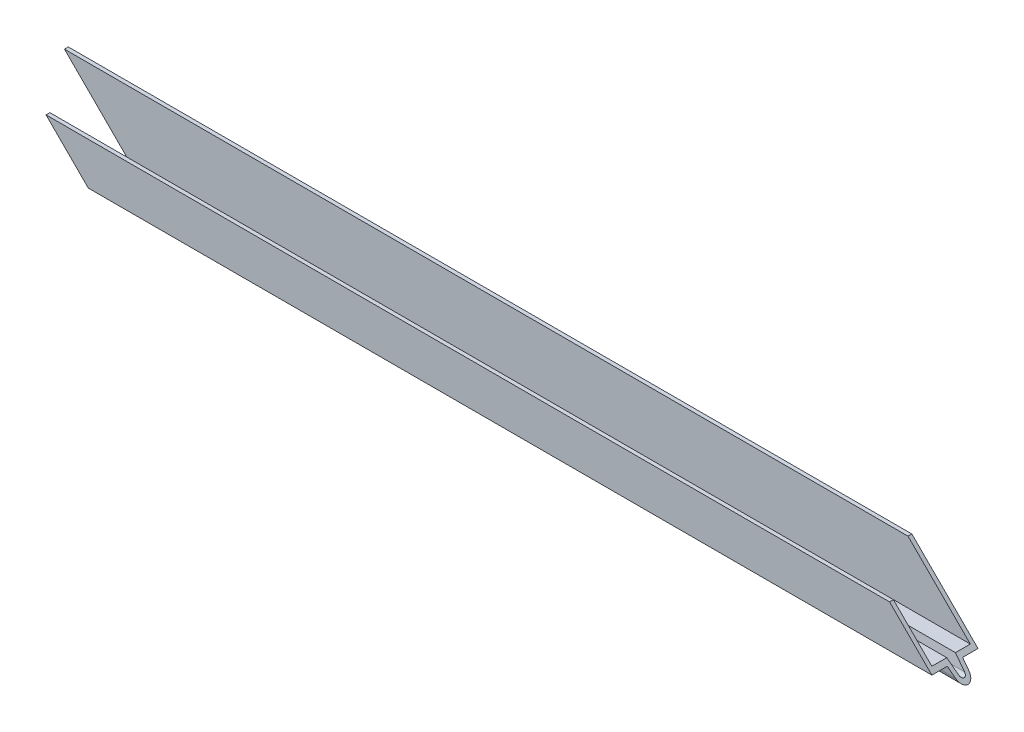
ISO-10303-21;
HEADER;
FILE_DESCRIPTION(('STEP AP214'),'2;1');
FILE_NAME('part.step','',(''),(''),'','','');
FILE_SCHEMA(('AUTOMOTIVE_DESIGN { 1 0 10303 214 1 1 1 1 }'));
ENDSEC;
DATA;
#1=APPLICATION_CONTEXT('core data for automotive mechanical design processes');
#2=APPLICATION_PROTOCOL_DEFINITION('international standard','automotive_design',2000,#1);
#3=PRODUCT_CONTEXT('',#1,'mechanical');
#4=PRODUCT('Part','Part','',(#3));
#5=PRODUCT_RELATED_PRODUCT_CATEGORY('part','',(#4));
#6=PRODUCT_DEFINITION_FORMATION('','',#4);
#7=PRODUCT_DEFINITION_CONTEXT('part definition',#1,'design');
#8=PRODUCT_DEFINITION('design','',#6,#7);
#9=PRODUCT_DEFINITION_SHAPE('','',#8);
#10=(LENGTH_UNIT() NAMED_UNIT(*) SI_UNIT(.MILLI.,.METRE.));
#11=(NAMED_UNIT(*) PLANE_ANGLE_UNIT() SI_UNIT($,.RADIAN.));
#12=(NAMED_UNIT(*) SI_UNIT($,.STERADIAN.) SOLID_ANGLE_UNIT());
#13=UNCERTAINTY_MEASURE_WITH_UNIT(LENGTH_MEASURE(1.E-05),#10,'distance_accuracy_value','');
#14=(GEOMETRIC_REPRESENTATION_CONTEXT(3) GLOBAL_UNCERTAINTY_ASSIGNED_CONTEXT((#13)) GLOBAL_UNIT_ASSIGNED_CONTEXT((#10,
#11,#12)) REPRESENTATION_CONTEXT('',''));
#15=CARTESIAN_POINT('',(0.,0.,0.));
#16=DIRECTION('',(0.,0.,1.));
#17=DIRECTION('',(1.,0.,0.));
#18=AXIS2_PLACEMENT_3D('',#15,#16,#17);
#19=CARTESIAN_POINT('',(152.4,0.,-7.62));
#20=DIRECTION('',(0.,-1.,0.));
#21=DIRECTION('',(0.,0.,-1.));
#22=AXIS2_PLACEMENT_3D('',#19,#20,#21);
#23=PLANE('',#22);
#24=DIRECTION('',(-1.,0.,0.));
#25=VECTOR('',#24,1.);
#26=CARTESIAN_POINT('',(152.4,0.,-6.35));
#27=LINE('',#26,#25);
#28=CARTESIAN_POINT('',(126.238,0.,-6.35));
#29=VERTEX_POINT('',#28);
#30=CARTESIAN_POINT('',(-152.4,0.,-6.35));
#31=VERTEX_POINT('',#30);
#32=EDGE_CURVE('E11',#29,#31,#27,.T.);
#33=ORIENTED_EDGE('',*,*,#32,.F.);
#34=DIRECTION('',(0.,0.,1.));
#35=VECTOR('',#34,1.);
#36=CARTESIAN_POINT('',(126.238,0.,-7.62));
#37=LINE('',#36,#35);
#38=CARTESIAN_POINT('',(126.238,0.,-7.62));
#39=VERTEX_POINT('',#38);
#40=EDGE_CURVE('E157',#39,#29,#37,.T.);
#41=ORIENTED_EDGE('',*,*,#40,.F.);
#42=DIRECTION('',(-1.,0.,0.));
#43=VECTOR('',#42,1.);
#44=CARTESIAN_POINT('',(152.4,0.,-7.62));
#45=LINE('',#44,#43);
#46=CARTESIAN_POINT('',(-152.4,0.,-7.62));
#47=VERTEX_POINT('',#46);
#48=EDGE_CURVE('E165',#39,#47,#45,.T.);
#49=ORIENTED_EDGE('',*,*,#48,.T.);
#50=DIRECTION('',(0.,0.,1.));
#51=VECTOR('',#50,1.);
#52=CARTESIAN_POINT('',(-152.4,0.,-7.62));
#53=LINE('',#52,#51);
#54=EDGE_CURVE('E173',#47,#31,#53,.T.);
#55=ORIENTED_EDGE('',*,*,#54,.T.);
#56=EDGE_LOOP('',(#33,#41,#49,#55));
#57=FACE_BOUND('',#56,.T.);
#58=ADVANCED_FACE('F45',(#57),#23,.F.);
#59=CARTESIAN_POINT('',(152.4,0.,-6.35));
#60=DIRECTION('',(0.,0.,-1.));
#61=DIRECTION('',(-1.,0.,0.));
#62=AXIS2_PLACEMENT_3D('',#59,#60,#61);
#63=PLANE('',#62);
#64=DIRECTION('',(-1.,0.,0.));
#65=VECTOR('',#64,1.);
#66=CARTESIAN_POINT('',(152.4,-20.574,-6.35));
#67=LINE('',#66,#65);
#68=CARTESIAN_POINT('',(146.812,-20.574,-6.35));
#69=VERTEX_POINT('',#68);
#70=CARTESIAN_POINT('',(-131.826,-20.574,-6.35));
#71=VERTEX_POINT('',#70);
#72=EDGE_CURVE('E52',#69,#71,#67,.T.);
#73=ORIENTED_EDGE('',*,*,#72,.F.);
#74=DIRECTION('',(-0.707106781186547,0.707106781186548,0.));
#75=VECTOR('',#74,1.);
#76=CARTESIAN_POINT('',(139.319,-13.081,-6.35));
#77=LINE('',#76,#75);
#78=EDGE_CURVE('E255',#69,#29,#77,.T.);
#79=ORIENTED_EDGE('',*,*,#78,.T.);
#80=ORIENTED_EDGE('',*,*,#32,.T.);
#81=DIRECTION('',(0.70710678118655,-0.707106781186545,0.));
#82=VECTOR('',#81,1.);
#83=CARTESIAN_POINT('',(1.2490009027033E-12,-152.4,-6.35));
#84=LINE('',#83,#82);
#85=EDGE_CURVE('E177',#31,#71,#84,.T.);
#86=ORIENTED_EDGE('',*,*,#85,.T.);
#87=EDGE_LOOP('',(#73,#79,#80,#86));
#88=FACE_BOUND('',#87,.T.);
#89=ADVANCED_FACE('F219',(#88),#63,.F.);
#90=CARTESIAN_POINT('',(152.4,-20.574,-6.35));
#91=DIRECTION('',(0.,-1.,0.));
#92=DIRECTION('',(0.,0.,-1.));
#93=AXIS2_PLACEMENT_3D('',#90,#91,#92);
#94=PLANE('',#93);
#95=DIRECTION('',(-1.,0.,0.));
#96=VECTOR('',#95,1.);
#97=CARTESIAN_POINT('',(152.4,-20.574,-1.4360058429734));
#98=LINE('',#97,#96);
#99=CARTESIAN_POINT('',(146.812,-20.574,-1.4360058429734));
#100=VERTEX_POINT('',#99);
#101=CARTESIAN_POINT('',(-131.826,-20.574,-1.4360058429734));
#102=VERTEX_POINT('',#101);
#103=EDGE_CURVE('E202',#100,#102,#98,.T.);
#104=ORIENTED_EDGE('',*,*,#103,.F.);
#105=DIRECTION('',(0.,0.,-1.));
#106=VECTOR('',#105,1.);
#107=CARTESIAN_POINT('',(146.812,-20.574,-6.35));
#108=LINE('',#107,#106);
#109=EDGE_CURVE('E211',#100,#69,#108,.T.);
#110=ORIENTED_EDGE('',*,*,#109,.T.);
#111=ORIENTED_EDGE('',*,*,#72,.T.);
#112=DIRECTION('',(0.,0.,1.));
#113=VECTOR('',#112,1.);
#114=CARTESIAN_POINT('',(-131.826,-20.574,-6.3499999999998));
#115=LINE('',#114,#113);
#116=EDGE_CURVE('E210',#71,#102,#115,.T.);
#117=ORIENTED_EDGE('',*,*,#116,.T.);
#118=EDGE_LOOP('',(#104,#110,#111,#117));
#119=FACE_BOUND('',#118,.T.);
#120=ADVANCED_FACE('F209',(#119),#94,.F.);
#121=CARTESIAN_POINT('',(152.4,-24.0709187171227,-0.944545967582546));
#122=DIRECTION('',(0.,-0.139173100960069,-0.99026806874157));
#123=DIRECTION('',(0.,0.99026806874157,-0.139173100960069));
#124=AXIS2_PLACEMENT_3D('',#121,#122,#123);
#125=PLANE('',#124);
#126=DIRECTION('',(-1.,0.,0.));
#127=VECTOR('',#126,1.);
#128=CARTESIAN_POINT('',(152.4,-24.0709187171227,-0.944545967582547));
#129=LINE('',#128,#127);
#130=CARTESIAN_POINT('',(150.308918717123,-24.0709187171227,-0.944545967582547));
#131=VERTEX_POINT('',#130);
#132=CARTESIAN_POINT('',(-128.329081282877,-24.0709187171227,-0.944545967582547));
#133=VERTEX_POINT('',#132);
#134=EDGE_CURVE('E200',#131,#133,#129,.T.);
#135=ORIENTED_EDGE('',*,*,#134,.F.);
#136=DIRECTION('',(-0.703640787534026,0.703640787534027,-0.0988902636106829));
#137=VECTOR('',#136,1.);
#138=CARTESIAN_POINT('',(151.344234719447,-25.1062347194474,-0.799041792435087));
#139=LINE('',#138,#137);
#140=EDGE_CURVE('E259',#131,#100,#139,.T.);
#141=ORIENTED_EDGE('',*,*,#140,.T.);
#142=ORIENTED_EDGE('',*,*,#103,.T.);
#143=DIRECTION('',(0.703640787534029,-0.703640787534024,0.0988902636106825));
#144=VECTOR('',#143,1.);
#145=CARTESIAN_POINT('',(10.6627946188354,-163.062794618834,18.5894882884957));
#146=LINE('',#145,#144);
#147=EDGE_CURVE('E217',#102,#133,#146,.T.);
#148=ORIENTED_EDGE('',*,*,#147,.T.);
#149=EDGE_LOOP('',(#135,#141,#142,#148));
#150=FACE_BOUND('',#149,.T.);
#151=ADVANCED_FACE('F321',(#150),#125,.F.);
#152=CARTESIAN_POINT('',(152.4,-23.9381714384239,0.));
#153=DIRECTION('',(-1.,0.,0.));
#154=DIRECTION('',(0.,0.,1.));
#155=AXIS2_PLACEMENT_3D('',#152,#153,#154);
#156=CYLINDRICAL_SURFACE('',#155,0.95382856157613);
#157=DIRECTION('',(-1.,0.,0.));
#158=VECTOR('',#157,1.);
#159=CARTESIAN_POINT('',(152.4,-24.0709187171227,0.944545967582541));
#160=LINE('',#159,#158);
#161=CARTESIAN_POINT('',(150.308918717123,-24.0709187171227,0.944545967582541));
#162=VERTEX_POINT('',#161);
#163=CARTESIAN_POINT('',(-128.329081282877,-24.0709187171227,0.944545967582543));
#164=VERTEX_POINT('',#163);
#165=EDGE_CURVE('E198',#162,#164,#160,.T.);
#166=ORIENTED_EDGE('',*,*,#165,.F.);
#167=CARTESIAN_POINT('',(150.176171438424,-23.9381714384239,0.));
#168=DIRECTION('',(-0.707106781186548,-0.707106781186547,0.));
#169=DIRECTION('',(-0.707106781186547,0.707106781186548,0.));
#170=AXIS2_PLACEMENT_3D('',#167,#168,#169);
#171=ELLIPSE('',#170,1.34891728795978,0.95382856157613);
#172=EDGE_CURVE('E262',#162,#131,#171,.F.);
#173=ORIENTED_EDGE('',*,*,#172,.T.);
#174=ORIENTED_EDGE('',*,*,#134,.T.);
#175=CARTESIAN_POINT('',(-128.461828561576,-23.9381714384239,0.));
#176=DIRECTION('',(0.707106781186545,0.70710678118655,0.));
#177=DIRECTION('',(-0.70710678118655,0.707106781186545,0.));
#178=AXIS2_PLACEMENT_3D('',#175,#176,#177);
#179=ELLIPSE('',#178,1.34891728795979,0.95382856157613);
#180=EDGE_CURVE('E222',#133,#164,#179,.F.);
#181=ORIENTED_EDGE('',*,*,#180,.T.);
#182=EDGE_LOOP('',(#166,#173,#174,#181));
#183=FACE_BOUND('',#182,.T.);
#184=ADVANCED_FACE('F318',(#183),#156,.F.);
#185=CARTESIAN_POINT('',(152.4,-20.574,1.43600584297339));
#186=DIRECTION('',(0.,-0.139173100960069,0.99026806874157));
#187=DIRECTION('',(0.,-0.99026806874157,-0.139173100960069));
#188=AXIS2_PLACEMENT_3D('',#185,#186,#187);
#189=PLANE('',#188);
#190=DIRECTION('',(-1.,0.,0.));
#191=VECTOR('',#190,1.);
#192=CARTESIAN_POINT('',(152.4,-20.574,1.43600584297339));
#193=LINE('',#192,#191);
#194=CARTESIAN_POINT('',(146.812,-20.574,1.43600584297339));
#195=VERTEX_POINT('',#194);
#196=CARTESIAN_POINT('',(-131.826,-20.574,1.43600584297339));
#197=VERTEX_POINT('',#196);
#198=EDGE_CURVE('E196',#195,#197,#193,.T.);
#199=ORIENTED_EDGE('',*,*,#198,.F.);
#200=DIRECTION('',(0.703640787534026,-0.703640787534027,-0.0988902636106828));
#201=VECTOR('',#200,1.);
#202=CARTESIAN_POINT('',(149.578676679842,-23.3406766798418,1.04717479303677));
#203=LINE('',#202,#201);
#204=EDGE_CURVE('E265',#195,#162,#203,.T.);
#205=ORIENTED_EDGE('',*,*,#204,.T.);
#206=ORIENTED_EDGE('',*,*,#165,.T.);
#207=DIRECTION('',(-0.703640787534029,0.703640787534024,0.0988902636106824));
#208=VECTOR('',#207,1.);
#209=CARTESIAN_POINT('',(8.89723657922983,-161.297236579229,-18.341355287894));
#210=LINE('',#209,#208);
#211=EDGE_CURVE('E225',#164,#197,#210,.T.);
#212=ORIENTED_EDGE('',*,*,#211,.T.);
#213=EDGE_LOOP('',(#199,#205,#206,#212));
#214=FACE_BOUND('',#213,.T.);
#215=ADVANCED_FACE('F315',(#214),#189,.F.);
#216=CARTESIAN_POINT('',(152.4,-20.574,1.43600584297339));
#217=DIRECTION('',(0.,-1.,0.));
#218=DIRECTION('',(0.,0.,-1.));
#219=AXIS2_PLACEMENT_3D('',#216,#217,#218);
#220=PLANE('',#219);
#221=DIRECTION('',(-1.,0.,0.));
#222=VECTOR('',#221,1.);
#223=CARTESIAN_POINT('',(152.4,-20.574,6.35));
#224=LINE('',#223,#222);
#225=CARTESIAN_POINT('',(146.812,-20.574,6.35));
#226=VERTEX_POINT('',#225);
#227=CARTESIAN_POINT('',(-131.826,-20.574,6.35));
#228=VERTEX_POINT('',#227);
#229=EDGE_CURVE('E194',#226,#228,#224,.T.);
#230=ORIENTED_EDGE('',*,*,#229,.F.);
#231=DIRECTION('',(0.,0.,-1.));
#232=VECTOR('',#231,1.);
#233=CARTESIAN_POINT('',(146.812,-20.574,1.43600584297339));
#234=LINE('',#233,#232);
#235=EDGE_CURVE('E268',#226,#195,#234,.T.);
#236=ORIENTED_EDGE('',*,*,#235,.T.);
#237=ORIENTED_EDGE('',*,*,#198,.T.);
#238=DIRECTION('',(0.,0.,1.));
#239=VECTOR('',#238,1.);
#240=CARTESIAN_POINT('',(-131.826,-20.574,1.43600584297319));
#241=LINE('',#240,#239);
#242=EDGE_CURVE('E228',#197,#228,#241,.T.);
#243=ORIENTED_EDGE('',*,*,#242,.T.);
#244=EDGE_LOOP('',(#230,#236,#237,#243));
#245=FACE_BOUND('',#244,.T.);
#246=ADVANCED_FACE('F312',(#245),#220,.F.);
#247=CARTESIAN_POINT('',(152.4,-20.574,6.35));
#248=DIRECTION('',(0.,0.,1.));
#249=DIRECTION('',(0.,-1.,0.));
#250=AXIS2_PLACEMENT_3D('',#247,#248,#249);
#251=PLANE('',#250);
#252=DIRECTION('',(-1.,0.,0.));
#253=VECTOR('',#252,1.);
#254=CARTESIAN_POINT('',(152.4,-7.874,6.35));
#255=LINE('',#254,#253);
#256=CARTESIAN_POINT('',(134.112,-7.874,6.35));
#257=VERTEX_POINT('',#256);
#258=CARTESIAN_POINT('',(-144.526,-7.874,6.35));
#259=VERTEX_POINT('',#258);
#260=EDGE_CURVE('E192',#257,#259,#255,.T.);
#261=ORIENTED_EDGE('',*,*,#260,.F.);
#262=DIRECTION('',(0.707106781186547,-0.707106781186548,0.));
#263=VECTOR('',#262,1.);
#264=CARTESIAN_POINT('',(149.606,-23.368,6.35));
#265=LINE('',#264,#263);
#266=EDGE_CURVE('E271',#257,#226,#265,.T.);
#267=ORIENTED_EDGE('',*,*,#266,.T.);
#268=ORIENTED_EDGE('',*,*,#229,.T.);
#269=DIRECTION('',(-0.70710678118655,0.707106781186545,0.));
#270=VECTOR('',#269,1.);
#271=CARTESIAN_POINT('',(10.2870000000012,-162.687,6.34999999999998));
#272=LINE('',#271,#270);
#273=EDGE_CURVE('E231',#228,#259,#272,.T.);
#274=ORIENTED_EDGE('',*,*,#273,.T.);
#275=EDGE_LOOP('',(#261,#267,#268,#274));
#276=FACE_BOUND('',#275,.T.);
#277=ADVANCED_FACE('F307',(#276),#251,.F.);
#278=CARTESIAN_POINT('',(152.4,-7.874,7.62));
#279=DIRECTION('',(0.,-1.,0.));
#280=DIRECTION('',(0.,0.,-1.));
#281=AXIS2_PLACEMENT_3D('',#278,#279,#280);
#282=PLANE('',#281);
#283=DIRECTION('',(-1.,0.,0.));
#284=VECTOR('',#283,1.);
#285=CARTESIAN_POINT('',(152.4,-7.874,7.62));
#286=LINE('',#285,#284);
#287=CARTESIAN_POINT('',(134.112,-7.87399999999999,7.62));
#288=VERTEX_POINT('',#287);
#289=CARTESIAN_POINT('',(-144.526,-7.87399999999999,7.62));
#290=VERTEX_POINT('',#289);
#291=EDGE_CURVE('E190',#288,#290,#286,.T.);
#292=ORIENTED_EDGE('',*,*,#291,.F.);
#293=DIRECTION('',(0.,0.,-1.));
#294=VECTOR('',#293,1.);
#295=CARTESIAN_POINT('',(134.112,-7.874,7.62));
#296=LINE('',#295,#294);
#297=EDGE_CURVE('E274',#288,#257,#296,.T.);
#298=ORIENTED_EDGE('',*,*,#297,.T.);
#299=ORIENTED_EDGE('',*,*,#260,.T.);
#300=DIRECTION('',(0.,0.,1.));
#301=VECTOR('',#300,1.);
#302=CARTESIAN_POINT('',(-144.526,-7.874,7.62));
#303=LINE('',#302,#301);
#304=EDGE_CURVE('E234',#259,#290,#303,.T.);
#305=ORIENTED_EDGE('',*,*,#304,.T.);
#306=EDGE_LOOP('',(#292,#298,#299,#305));
#307=FACE_BOUND('',#306,.T.);
#308=ADVANCED_FACE('F304',(#307),#282,.F.);
#309=CARTESIAN_POINT('',(152.4,-21.844,7.62));
#310=DIRECTION('',(0.,0.,-1.));
#311=DIRECTION('',(-1.,0.,0.));
#312=AXIS2_PLACEMENT_3D('',#309,#310,#311);
#313=PLANE('',#312);
#314=DIRECTION('',(-1.,0.,0.));
#315=VECTOR('',#314,1.);
#316=CARTESIAN_POINT('',(152.4,-21.844,7.62));
#317=LINE('',#316,#315);
#318=CARTESIAN_POINT('',(148.082,-21.844,7.62));
#319=VERTEX_POINT('',#318);
#320=CARTESIAN_POINT('',(-130.556,-21.844,7.62));
#321=VERTEX_POINT('',#320);
#322=EDGE_CURVE('E188',#319,#321,#317,.T.);
#323=ORIENTED_EDGE('',*,*,#322,.F.);
#324=DIRECTION('',(0.707106781186547,-0.707106781186548,0.));
#325=VECTOR('',#324,1.);
#326=CARTESIAN_POINT('',(152.4,-26.162,7.62));
#327=LINE('',#326,#325);
#328=EDGE_CURVE('E161',#288,#319,#327,.T.);
#329=ORIENTED_EDGE('',*,*,#328,.F.);
#330=ORIENTED_EDGE('',*,*,#291,.T.);
#331=DIRECTION('',(-0.70710678118655,0.707106781186545,0.));
#332=VECTOR('',#331,1.);
#333=CARTESIAN_POINT('',(-152.4,0.,7.62));
#334=LINE('',#333,#332);
#335=EDGE_CURVE('E252',#321,#290,#334,.T.);
#336=ORIENTED_EDGE('',*,*,#335,.F.);
#337=EDGE_LOOP('',(#323,#329,#330,#336));
#338=FACE_BOUND('',#337,.T.);
#339=ADVANCED_FACE('F299',(#338),#313,.F.);
#340=CARTESIAN_POINT('',(152.4,-21.844,2.54));
#341=DIRECTION('',(0.,1.,0.));
#342=DIRECTION('',(0.,0.,1.));
#343=AXIS2_PLACEMENT_3D('',#340,#341,#342);
#344=PLANE('',#343);
#345=DIRECTION('',(-1.,0.,0.));
#346=VECTOR('',#345,1.);
#347=CARTESIAN_POINT('',(152.4,-21.844,2.54));
#348=LINE('',#347,#346);
#349=CARTESIAN_POINT('',(148.082,-21.844,2.54));
#350=VERTEX_POINT('',#349);
#351=CARTESIAN_POINT('',(-130.556,-21.844,2.54));
#352=VERTEX_POINT('',#351);
#353=EDGE_CURVE('E186',#350,#352,#348,.T.);
#354=ORIENTED_EDGE('',*,*,#353,.F.);
#355=DIRECTION('',(0.,0.,1.));
#356=VECTOR('',#355,1.);
#357=CARTESIAN_POINT('',(148.082,-21.844,2.53999999999999));
#358=LINE('',#357,#356);
#359=EDGE_CURVE('E277',#350,#319,#358,.T.);
#360=ORIENTED_EDGE('',*,*,#359,.T.);
#361=ORIENTED_EDGE('',*,*,#322,.T.);
#362=DIRECTION('',(0.,0.,-1.));
#363=VECTOR('',#362,1.);
#364=CARTESIAN_POINT('',(-130.556,-21.844,2.5399999999998));
#365=LINE('',#364,#363);
#366=EDGE_CURVE('E237',#321,#352,#365,.T.);
#367=ORIENTED_EDGE('',*,*,#366,.T.);
#368=EDGE_LOOP('',(#354,#360,#361,#367));
#369=FACE_BOUND('',#368,.T.);
#370=ADVANCED_FACE('F296',(#369),#344,.F.);
#371=CARTESIAN_POINT('',(152.4,-21.844,2.54));
#372=DIRECTION('',(0.,0.13917310096007,-0.99026806874157));
#373=DIRECTION('',(0.,0.99026806874157,0.13917310096007));
#374=AXIS2_PLACEMENT_3D('',#371,#372,#373);
#375=PLANE('',#374);
#376=DIRECTION('',(-1.,0.,0.));
#377=VECTOR('',#376,1.);
#378=CARTESIAN_POINT('',(152.4,-24.247668555342,2.20218641488433));
#379=LINE('',#378,#377);
#380=CARTESIAN_POINT('',(150.485668555342,-24.247668555342,2.20218641488433));
#381=VERTEX_POINT('',#380);
#382=CARTESIAN_POINT('',(-128.152331444658,-24.247668555342,2.20218641488433));
#383=VERTEX_POINT('',#382);
#384=EDGE_CURVE('E184',#381,#383,#379,.T.);
#385=ORIENTED_EDGE('',*,*,#384,.F.);
#386=DIRECTION('',(-0.703640787534026,0.703640787534027,0.0988902636106832));
#387=VECTOR('',#386,1.);
#388=CARTESIAN_POINT('',(150.219886525332,-23.9818865253323,2.23953964323079));
#389=LINE('',#388,#387);
#390=EDGE_CURVE('E280',#381,#350,#389,.T.);
#391=ORIENTED_EDGE('',*,*,#390,.T.);
#392=ORIENTED_EDGE('',*,*,#353,.T.);
#393=DIRECTION('',(0.703640787534029,-0.703640787534024,-0.0988902636106828));
#394=VECTOR('',#393,1.);
#395=CARTESIAN_POINT('',(9.53844642472032,-161.938446424719,-17.1489904377001));
#396=LINE('',#395,#394);
#397=EDGE_CURVE('E240',#352,#383,#396,.T.);
#398=ORIENTED_EDGE('',*,*,#397,.T.);
#399=EDGE_LOOP('',(#385,#391,#392,#398));
#400=FACE_BOUND('',#399,.T.);
#401=ADVANCED_FACE('F399',(#400),#375,.F.);
#402=CARTESIAN_POINT('',(152.4,-23.9381714384239,0.));
#403=DIRECTION('',(-1.,0.,0.));
#404=DIRECTION('',(0.,0.,1.));
#405=AXIS2_PLACEMENT_3D('',#402,#403,#404);
#406=CYLINDRICAL_SURFACE('',#405,2.22382856157613);
#407=DIRECTION('',(-1.,0.,0.));
#408=VECTOR('',#407,1.);
#409=CARTESIAN_POINT('',(152.4,-24.247668555342,-2.20218641488434));
#410=LINE('',#409,#408);
#411=CARTESIAN_POINT('',(150.485668555342,-24.247668555342,-2.20218641488434));
#412=VERTEX_POINT('',#411);
#413=CARTESIAN_POINT('',(-128.152331444658,-24.247668555342,-2.20218641488434));
#414=VERTEX_POINT('',#413);
#415=EDGE_CURVE('E182',#412,#414,#410,.T.);
#416=ORIENTED_EDGE('',*,*,#415,.F.);
#417=CARTESIAN_POINT('',(150.176171438424,-23.9381714384239,0.));
#418=DIRECTION('',(-0.707106781186548,-0.707106781186547,0.));
#419=DIRECTION('',(-0.707106781186547,0.707106781186548,0.));
#420=AXIS2_PLACEMENT_3D('',#417,#418,#419);
#421=ELLIPSE('',#420,3.14496851217361,2.22382856157613);
#422=EDGE_CURVE('E283',#412,#381,#421,.T.);
#423=ORIENTED_EDGE('',*,*,#422,.T.);
#424=ORIENTED_EDGE('',*,*,#384,.T.);
#425=CARTESIAN_POINT('',(-128.461828561576,-23.9381714384239,0.));
#426=DIRECTION('',(0.707106781186545,0.70710678118655,0.));
#427=DIRECTION('',(-0.70710678118655,0.707106781186545,0.));
#428=AXIS2_PLACEMENT_3D('',#425,#426,#427);
#429=ELLIPSE('',#428,3.14496851217363,2.22382856157613);
#430=EDGE_CURVE('E243',#383,#414,#429,.T.);
#431=ORIENTED_EDGE('',*,*,#430,.T.);
#432=EDGE_LOOP('',(#416,#423,#424,#431));
#433=FACE_BOUND('',#432,.T.);
#434=ADVANCED_FACE('F408',(#433),#406,.T.);
#435=CARTESIAN_POINT('',(152.4,-24.247668555342,-2.20218641488434));
#436=DIRECTION('',(0.,0.139173100960069,0.99026806874157));
#437=DIRECTION('',(0.,-0.99026806874157,0.139173100960069));
#438=AXIS2_PLACEMENT_3D('',#435,#436,#437);
#439=PLANE('',#438);
#440=DIRECTION('',(-1.,0.,0.));
#441=VECTOR('',#440,1.);
#442=CARTESIAN_POINT('',(152.4,-21.844,-2.54));
#443=LINE('',#442,#441);
#444=CARTESIAN_POINT('',(148.082,-21.844,-2.54));
#445=VERTEX_POINT('',#444);
#446=CARTESIAN_POINT('',(-130.556,-21.844,-2.54));
#447=VERTEX_POINT('',#446);
#448=EDGE_CURVE('E175',#445,#447,#443,.T.);
#449=ORIENTED_EDGE('',*,*,#448,.F.);
#450=DIRECTION('',(0.703640787534026,-0.703640787534027,0.0988902636106829));
#451=VECTOR('',#450,1.);
#452=CARTESIAN_POINT('',(151.43347388201,-25.1954738820104,-2.06898106313898));
#453=LINE('',#452,#451);
#454=EDGE_CURVE('E285',#445,#412,#453,.T.);
#455=ORIENTED_EDGE('',*,*,#454,.T.);
#456=ORIENTED_EDGE('',*,*,#415,.T.);
#457=DIRECTION('',(-0.703640787534029,0.703640787534024,-0.0988902636106825));
#458=VECTOR('',#457,1.);
#459=CARTESIAN_POINT('',(10.7520337813984,-163.152033781397,17.3195490177918));
#460=LINE('',#459,#458);
#461=EDGE_CURVE('E246',#414,#447,#460,.T.);
#462=ORIENTED_EDGE('',*,*,#461,.T.);
#463=EDGE_LOOP('',(#449,#455,#456,#462));
#464=FACE_BOUND('',#463,.T.);
#465=ADVANCED_FACE('F418',(#464),#439,.F.);
#466=CARTESIAN_POINT('',(152.4,-21.844,-7.62));
#467=DIRECTION('',(0.,1.,0.));
#468=DIRECTION('',(0.,0.,1.));
#469=AXIS2_PLACEMENT_3D('',#466,#467,#468);
#470=PLANE('',#469);
#471=DIRECTION('',(-1.,0.,0.));
#472=VECTOR('',#471,1.);
#473=CARTESIAN_POINT('',(152.4,-21.844,-7.62));
#474=LINE('',#473,#472);
#475=CARTESIAN_POINT('',(148.082,-21.844,-7.62));
#476=VERTEX_POINT('',#475);
#477=CARTESIAN_POINT('',(-130.556,-21.844,-7.62));
#478=VERTEX_POINT('',#477);
#479=EDGE_CURVE('E172',#476,#478,#474,.T.);
#480=ORIENTED_EDGE('',*,*,#479,.F.);
#481=DIRECTION('',(0.,0.,1.));
#482=VECTOR('',#481,1.);
#483=CARTESIAN_POINT('',(148.082,-21.844,-7.62));
#484=LINE('',#483,#482);
#485=EDGE_CURVE('E59',#476,#445,#484,.T.);
#486=ORIENTED_EDGE('',*,*,#485,.T.);
#487=ORIENTED_EDGE('',*,*,#448,.T.);
#488=DIRECTION('',(0.,0.,-1.));
#489=VECTOR('',#488,1.);
#490=CARTESIAN_POINT('',(-130.556,-21.844,-7.61999999999981));
#491=LINE('',#490,#489);
#492=EDGE_CURVE('E249',#447,#478,#491,.T.);
#493=ORIENTED_EDGE('',*,*,#492,.T.);
#494=EDGE_LOOP('',(#480,#486,#487,#493));
#495=FACE_BOUND('',#494,.T.);
#496=ADVANCED_FACE('F428',(#495),#470,.F.);
#497=CARTESIAN_POINT('',(152.4,0.,-7.62));
#498=DIRECTION('',(0.,0.,1.));
#499=DIRECTION('',(0.,-1.,0.));
#500=AXIS2_PLACEMENT_3D('',#497,#498,#499);
#501=PLANE('',#500);
#502=ORIENTED_EDGE('',*,*,#48,.F.);
#503=DIRECTION('',(0.707106781186547,-0.707106781186548,0.));
#504=VECTOR('',#503,1.);
#505=CARTESIAN_POINT('',(152.4,-26.162,-7.62));
#506=LINE('',#505,#504);
#507=EDGE_CURVE('E154',#39,#476,#506,.T.);
#508=ORIENTED_EDGE('',*,*,#507,.T.);
#509=ORIENTED_EDGE('',*,*,#479,.T.);
#510=DIRECTION('',(-0.70710678118655,0.707106781186545,0.));
#511=VECTOR('',#510,1.);
#512=CARTESIAN_POINT('',(-152.4,0.,-7.62));
#513=LINE('',#512,#511);
#514=EDGE_CURVE('E171',#478,#47,#513,.T.);
#515=ORIENTED_EDGE('',*,*,#514,.T.);
#516=EDGE_LOOP('',(#502,#508,#509,#515));
#517=FACE_BOUND('',#516,.T.);
#518=ADVANCED_FACE('F169',(#517),#501,.F.);
#519=CARTESIAN_POINT('',(-152.4,0.,-7.62));
#520=DIRECTION('',(0.707106781186545,0.70710678118655,0.));
#521=DIRECTION('',(-0.70710678118655,0.707106781186545,0.));
#522=AXIS2_PLACEMENT_3D('',#519,#520,#521);
#523=PLANE('',#522);
#524=ORIENTED_EDGE('',*,*,#54,.F.);
#525=ORIENTED_EDGE('',*,*,#514,.F.);
#526=ORIENTED_EDGE('',*,*,#492,.F.);
#527=ORIENTED_EDGE('',*,*,#461,.F.);
#528=ORIENTED_EDGE('',*,*,#430,.F.);
#529=ORIENTED_EDGE('',*,*,#397,.F.);
#530=ORIENTED_EDGE('',*,*,#366,.F.);
#531=ORIENTED_EDGE('',*,*,#335,.T.);
#532=ORIENTED_EDGE('',*,*,#304,.F.);
#533=ORIENTED_EDGE('',*,*,#273,.F.);
#534=ORIENTED_EDGE('',*,*,#242,.F.);
#535=ORIENTED_EDGE('',*,*,#211,.F.);
#536=ORIENTED_EDGE('',*,*,#180,.F.);
#537=ORIENTED_EDGE('',*,*,#147,.F.);
#538=ORIENTED_EDGE('',*,*,#116,.F.);
#539=ORIENTED_EDGE('',*,*,#85,.F.);
#540=EDGE_LOOP('',(#524,#525,#526,#527,#528,#529,#530,#531,#532,#533,#534,#535,#536,#537,#538,#539));
#541=FACE_BOUND('',#540,.T.);
#542=ADVANCED_FACE('F214',(#541),#523,.F.);
#543=CARTESIAN_POINT('',(152.4,-26.162,-7.62));
#544=DIRECTION('',(-0.707106781186548,-0.707106781186547,0.));
#545=DIRECTION('',(0.707106781186547,-0.707106781186548,0.));
#546=AXIS2_PLACEMENT_3D('',#543,#544,#545);
#547=PLANE('',#546);
#548=ORIENTED_EDGE('',*,*,#109,.F.);
#549=ORIENTED_EDGE('',*,*,#140,.F.);
#550=ORIENTED_EDGE('',*,*,#172,.F.);
#551=ORIENTED_EDGE('',*,*,#204,.F.);
#552=ORIENTED_EDGE('',*,*,#235,.F.);
#553=ORIENTED_EDGE('',*,*,#266,.F.);
#554=ORIENTED_EDGE('',*,*,#297,.F.);
#555=ORIENTED_EDGE('',*,*,#328,.T.);
#556=ORIENTED_EDGE('',*,*,#359,.F.);
#557=ORIENTED_EDGE('',*,*,#390,.F.);
#558=ORIENTED_EDGE('',*,*,#422,.F.);
#559=ORIENTED_EDGE('',*,*,#454,.F.);
#560=ORIENTED_EDGE('',*,*,#485,.F.);
#561=ORIENTED_EDGE('',*,*,#507,.F.);
#562=ORIENTED_EDGE('',*,*,#40,.T.);
#563=ORIENTED_EDGE('',*,*,#78,.F.);
#564=EDGE_LOOP('',(#548,#549,#550,#551,#552,#553,#554,#555,#556,#557,#558,#559,#560,#561,#562,#563));
#565=FACE_BOUND('',#564,.T.);
#566=ADVANCED_FACE('F156',(#565),#547,.F.);
#567=CLOSED_SHELL('',(#58,#89,#120,#151,#184,#215,#246,#277,#308,#339,#370,#401,#434,#465,#496,
#518,#542,#566));
#568=MANIFOLD_SOLID_BREP('B2',#567);
#569=ADVANCED_BREP_SHAPE_REPRESENTATION('',(#18,#568),#14);
#570=SHAPE_DEFINITION_REPRESENTATION(#9,#569);
ENDSEC;
END-ISO-10303-21;
